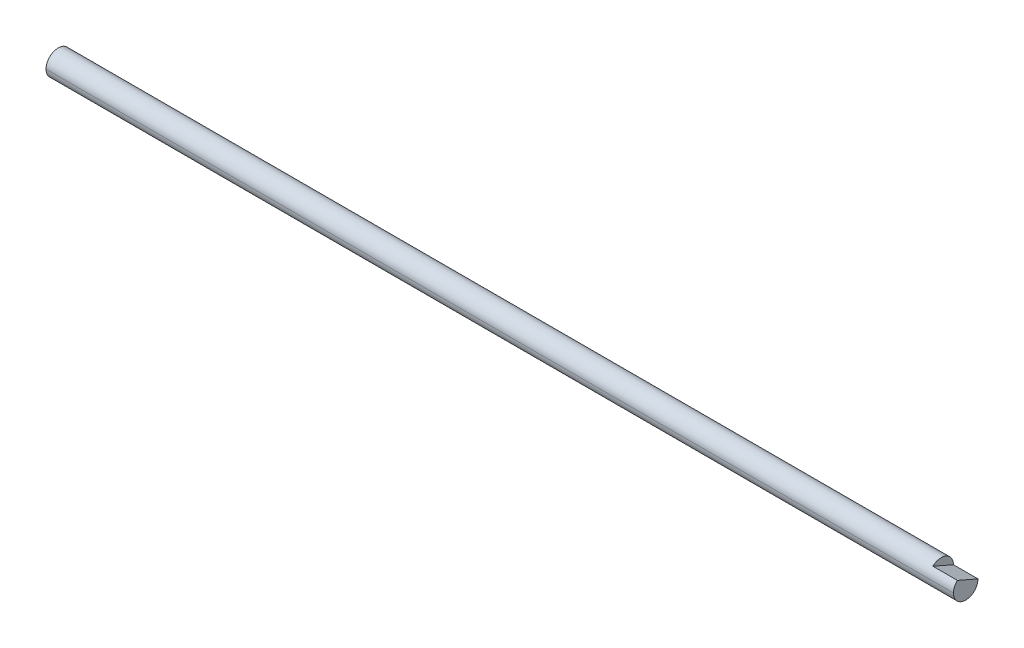
ISO-10303-21;
HEADER;
FILE_DESCRIPTION(('STEP AP214'),'2;1');
FILE_NAME('part.step','',(''),(''),'','','');
FILE_SCHEMA(('AUTOMOTIVE_DESIGN { 1 0 10303 214 1 1 1 1 }'));
ENDSEC;
DATA;
#1=APPLICATION_CONTEXT('core data for automotive mechanical design processes');
#2=APPLICATION_PROTOCOL_DEFINITION('international standard','automotive_design',2000,#1);
#3=PRODUCT_CONTEXT('',#1,'mechanical');
#4=PRODUCT('Part','Part','',(#3));
#5=PRODUCT_RELATED_PRODUCT_CATEGORY('part','',(#4));
#6=PRODUCT_DEFINITION_FORMATION('','',#4);
#7=PRODUCT_DEFINITION_CONTEXT('part definition',#1,'design');
#8=PRODUCT_DEFINITION('design','',#6,#7);
#9=PRODUCT_DEFINITION_SHAPE('','',#8);
#10=(LENGTH_UNIT() NAMED_UNIT(*) SI_UNIT(.MILLI.,.METRE.));
#11=(NAMED_UNIT(*) PLANE_ANGLE_UNIT() SI_UNIT($,.RADIAN.));
#12=(NAMED_UNIT(*) SI_UNIT($,.STERADIAN.) SOLID_ANGLE_UNIT());
#13=UNCERTAINTY_MEASURE_WITH_UNIT(LENGTH_MEASURE(1.E-05),#10,'distance_accuracy_value','');
#14=(GEOMETRIC_REPRESENTATION_CONTEXT(3) GLOBAL_UNCERTAINTY_ASSIGNED_CONTEXT((#13)) GLOBAL_UNIT_ASSIGNED_CONTEXT((#10,
#11,#12)) REPRESENTATION_CONTEXT('',''));
#15=CARTESIAN_POINT('',(0.,0.,0.));
#16=DIRECTION('',(0.,0.,1.));
#17=DIRECTION('',(1.,0.,0.));
#18=AXIS2_PLACEMENT_3D('',#15,#16,#17);
#19=CARTESIAN_POINT('',(600.,0.,0.));
#20=DIRECTION('',(1.,0.,0.));
#21=DIRECTION('',(0.,-1.,0.));
#22=AXIS2_PLACEMENT_3D('',#19,#20,#21);
#23=CYLINDRICAL_SURFACE('',#22,5.);
#24=DIRECTION('',(1.,0.,0.));
#25=VECTOR('',#24,1.);
#26=CARTESIAN_POINT('',(360.,3.66606055596467,3.4));
#27=LINE('',#26,#25);
#28=CARTESIAN_POINT('',(360.,3.66606055596467,3.4));
#29=VERTEX_POINT('',#28);
#30=CARTESIAN_POINT('',(370.,3.66606055596467,3.4));
#31=VERTEX_POINT('',#30);
#32=EDGE_CURVE('E58',#29,#31,#27,.T.);
#33=ORIENTED_EDGE('',*,*,#32,.F.);
#34=CARTESIAN_POINT('',(360.,0.,0.));
#35=DIRECTION('',(1.,0.,0.));
#36=DIRECTION('',(0.,0.,-1.));
#37=AXIS2_PLACEMENT_3D('',#34,#35,#36);
#38=CIRCLE('',#37,5.);
#39=CARTESIAN_POINT('',(360.,0.,-5.));
#40=VERTEX_POINT('',#39);
#41=EDGE_CURVE('E83',#40,#29,#38,.T.);
#42=ORIENTED_EDGE('',*,*,#41,.F.);
#43=DIRECTION('',(1.,0.,0.));
#44=VECTOR('',#43,1.);
#45=CARTESIAN_POINT('',(0.,0.,-5.));
#46=LINE('',#45,#44);
#47=CARTESIAN_POINT('',(0.,0.,-5.));
#48=VERTEX_POINT('',#47);
#49=EDGE_CURVE('E102',#48,#40,#46,.T.);
#50=ORIENTED_EDGE('',*,*,#49,.F.);
#51=CARTESIAN_POINT('',(0.,0.,0.));
#52=DIRECTION('',(1.,0.,0.));
#53=DIRECTION('',(0.,0.,-1.));
#54=AXIS2_PLACEMENT_3D('',#51,#52,#53);
#55=CIRCLE('',#54,5.);
#56=CARTESIAN_POINT('',(0.,0.,5.));
#57=VERTEX_POINT('',#56);
#58=EDGE_CURVE('E51',#48,#57,#55,.T.);
#59=ORIENTED_EDGE('',*,*,#58,.T.);
#60=DIRECTION('',(1.,0.,0.));
#61=VECTOR('',#60,1.);
#62=CARTESIAN_POINT('',(0.,0.,5.));
#63=LINE('',#62,#61);
#64=CARTESIAN_POINT('',(370.,0.,5.));
#65=VERTEX_POINT('',#64);
#66=EDGE_CURVE('E104',#57,#65,#63,.T.);
#67=ORIENTED_EDGE('',*,*,#66,.T.);
#68=CARTESIAN_POINT('',(370.,0.,0.));
#69=DIRECTION('',(1.,0.,0.));
#70=DIRECTION('',(0.,0.,-1.));
#71=AXIS2_PLACEMENT_3D('',#68,#69,#70);
#72=CIRCLE('',#71,5.);
#73=EDGE_CURVE('E65',#31,#65,#72,.T.);
#74=ORIENTED_EDGE('',*,*,#73,.F.);
#75=EDGE_LOOP('',(#33,#42,#50,#59,#67,#74));
#76=FACE_BOUND('',#75,.T.);
#77=ADVANCED_FACE('F42',(#76),#23,.T.);
#78=CARTESIAN_POINT('',(600.,0.,0.));
#79=DIRECTION('',(1.,0.,0.));
#80=DIRECTION('',(0.,1.,0.));
#81=AXIS2_PLACEMENT_3D('',#78,#79,#80);
#82=CYLINDRICAL_SURFACE('',#81,5.);
#83=ORIENTED_EDGE('',*,*,#49,.T.);
#84=DIRECTION('',(1.,0.,0.));
#85=VECTOR('',#84,1.);
#86=CARTESIAN_POINT('',(360.,0.,-5.));
#87=LINE('',#86,#85);
#88=CARTESIAN_POINT('',(370.,0.,-5.));
#89=VERTEX_POINT('',#88);
#90=EDGE_CURVE('E93',#40,#89,#87,.T.);
#91=ORIENTED_EDGE('',*,*,#90,.T.);
#92=EDGE_CURVE('E97',#65,#89,#72,.T.);
#93=ORIENTED_EDGE('',*,*,#92,.F.);
#94=ORIENTED_EDGE('',*,*,#66,.F.);
#95=CARTESIAN_POINT('',(0.,0.,0.));
#96=DIRECTION('',(1.,0.,0.));
#97=DIRECTION('',(0.,0.,-1.));
#98=AXIS2_PLACEMENT_3D('',#95,#96,#97);
#99=CIRCLE('',#98,5.);
#100=EDGE_CURVE('E11',#57,#48,#99,.T.);
#101=ORIENTED_EDGE('',*,*,#100,.T.);
#102=EDGE_LOOP('',(#83,#91,#93,#94,#101));
#103=FACE_BOUND('',#102,.T.);
#104=ADVANCED_FACE('F116',(#103),#82,.T.);
#105=CARTESIAN_POINT('',(0.,0.,0.));
#106=DIRECTION('',(1.,0.,0.));
#107=DIRECTION('',(0.,0.,-1.));
#108=AXIS2_PLACEMENT_3D('',#105,#106,#107);
#109=PLANE('',#108);
#110=ORIENTED_EDGE('',*,*,#100,.F.);
#111=ORIENTED_EDGE('',*,*,#58,.F.);
#112=EDGE_LOOP('',(#110,#111));
#113=FACE_BOUND('',#112,.T.);
#114=ADVANCED_FACE('F44',(#113),#109,.F.);
#115=CARTESIAN_POINT('',(370.,0.,0.));
#116=DIRECTION('',(1.,0.,0.));
#117=DIRECTION('',(0.,0.,-1.));
#118=AXIS2_PLACEMENT_3D('',#115,#116,#117);
#119=PLANE('',#118);
#120=DIRECTION('',(0.,-0.4,-0.916515138991168));
#121=VECTOR('',#120,1.);
#122=CARTESIAN_POINT('',(370.,3.66606055596467,3.4));
#123=LINE('',#122,#121);
#124=EDGE_CURVE('E89',#31,#89,#123,.T.);
#125=ORIENTED_EDGE('',*,*,#124,.F.);
#126=ORIENTED_EDGE('',*,*,#73,.T.);
#127=ORIENTED_EDGE('',*,*,#92,.T.);
#128=EDGE_LOOP('',(#125,#126,#127));
#129=FACE_BOUND('',#128,.T.);
#130=ADVANCED_FACE('F117',(#129),#119,.T.);
#131=CARTESIAN_POINT('',(360.,3.66606055596467,3.4));
#132=DIRECTION('',(0.,-0.916515138991168,0.4));
#133=DIRECTION('',(0.,-0.4,-0.916515138991168));
#134=AXIS2_PLACEMENT_3D('',#131,#132,#133);
#135=PLANE('',#134);
#136=ORIENTED_EDGE('',*,*,#124,.T.);
#137=ORIENTED_EDGE('',*,*,#90,.F.);
#138=DIRECTION('',(0.,-0.4,-0.916515138991168));
#139=VECTOR('',#138,1.);
#140=CARTESIAN_POINT('',(360.,3.66606055596467,3.4));
#141=LINE('',#140,#139);
#142=EDGE_CURVE('E85',#29,#40,#141,.T.);
#143=ORIENTED_EDGE('',*,*,#142,.F.);
#144=ORIENTED_EDGE('',*,*,#32,.T.);
#145=EDGE_LOOP('',(#136,#137,#143,#144));
#146=FACE_BOUND('',#145,.T.);
#147=ADVANCED_FACE('F91',(#146),#135,.F.);
#148=CARTESIAN_POINT('',(360.,0.,0.));
#149=DIRECTION('',(1.,0.,0.));
#150=DIRECTION('',(0.,0.,-1.));
#151=AXIS2_PLACEMENT_3D('',#148,#149,#150);
#152=PLANE('',#151);
#153=ORIENTED_EDGE('',*,*,#41,.T.);
#154=ORIENTED_EDGE('',*,*,#142,.T.);
#155=EDGE_LOOP('',(#153,#154));
#156=FACE_BOUND('',#155,.T.);
#157=ADVANCED_FACE('F84',(#156),#152,.T.);
#158=CLOSED_SHELL('',(#77,#104,#114,#130,#147,#157));
#159=MANIFOLD_SOLID_BREP('B2',#158);
#160=ADVANCED_BREP_SHAPE_REPRESENTATION('',(#18,#159),#14);
#161=SHAPE_DEFINITION_REPRESENTATION(#9,#160);
ENDSEC;
END-ISO-10303-21;
